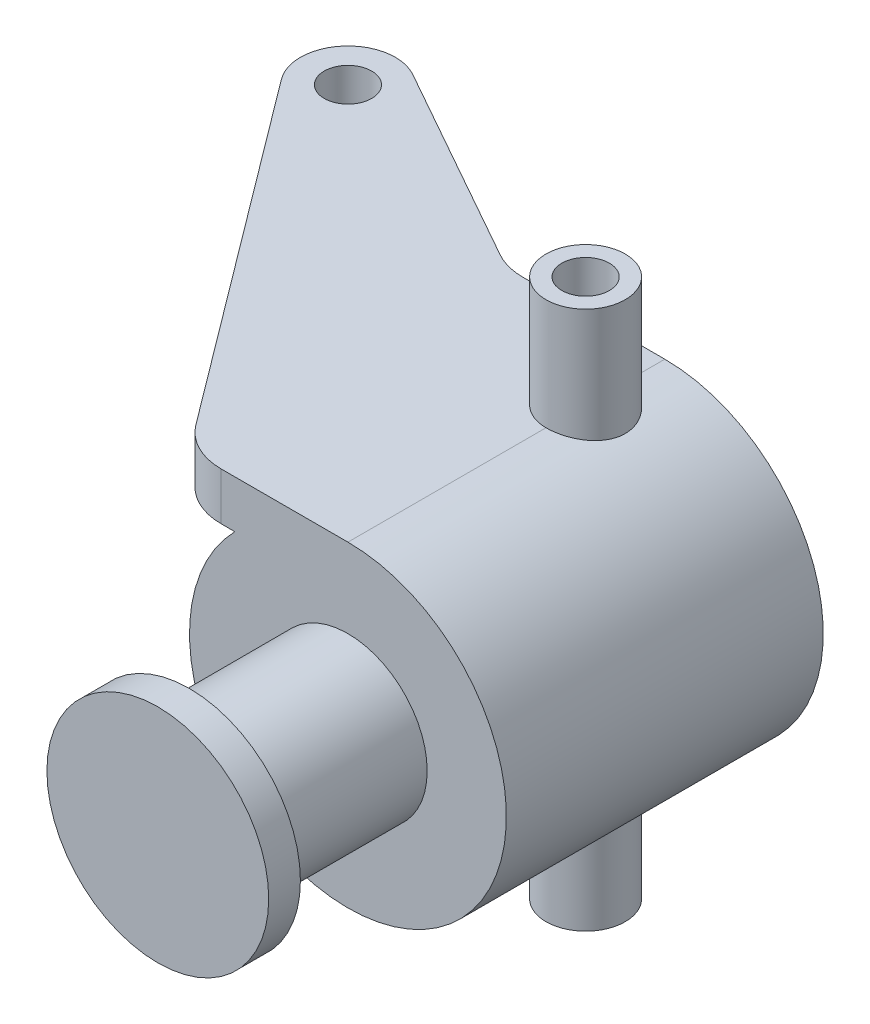
ISO-10303-21;
HEADER;
FILE_DESCRIPTION(('STEP AP214'),'2;1');
FILE_NAME('part.step','',(''),(''),'','','');
FILE_SCHEMA(('AUTOMOTIVE_DESIGN { 1 0 10303 214 1 1 1 1 }'));
ENDSEC;
DATA;
#1=APPLICATION_CONTEXT('core data for automotive mechanical design processes');
#2=APPLICATION_PROTOCOL_DEFINITION('international standard','automotive_design',2000,#1);
#3=PRODUCT_CONTEXT('',#1,'mechanical');
#4=PRODUCT('Part','Part','',(#3));
#5=PRODUCT_RELATED_PRODUCT_CATEGORY('part','',(#4));
#6=PRODUCT_DEFINITION_FORMATION('','',#4);
#7=PRODUCT_DEFINITION_CONTEXT('part definition',#1,'design');
#8=PRODUCT_DEFINITION('design','',#6,#7);
#9=PRODUCT_DEFINITION_SHAPE('','',#8);
#10=(LENGTH_UNIT() NAMED_UNIT(*) SI_UNIT(.MILLI.,.METRE.));
#11=(NAMED_UNIT(*) PLANE_ANGLE_UNIT() SI_UNIT($,.RADIAN.));
#12=(NAMED_UNIT(*) SI_UNIT($,.STERADIAN.) SOLID_ANGLE_UNIT());
#13=UNCERTAINTY_MEASURE_WITH_UNIT(LENGTH_MEASURE(1.E-05),#10,'distance_accuracy_value','');
#14=(GEOMETRIC_REPRESENTATION_CONTEXT(3) GLOBAL_UNCERTAINTY_ASSIGNED_CONTEXT((#13)) GLOBAL_UNIT_ASSIGNED_CONTEXT((#10,
#11,#12)) REPRESENTATION_CONTEXT('',''));
#15=CARTESIAN_POINT('',(0.,0.,0.));
#16=DIRECTION('',(0.,0.,1.));
#17=DIRECTION('',(1.,0.,0.));
#18=AXIS2_PLACEMENT_3D('',#15,#16,#17);
#19=CARTESIAN_POINT('',(0.,0.,-12.7));
#20=DIRECTION('',(0.,0.,1.));
#21=DIRECTION('',(-1.,0.,0.));
#22=AXIS2_PLACEMENT_3D('',#19,#20,#21);
#23=CYLINDRICAL_SURFACE('',#22,12.7);
#24=CARTESIAN_POINT('',(0.,-12.7,-3.175));
#25=CARTESIAN_POINT('',(0.175421054350931,-12.699997033873,-3.17500492281244));
#26=CARTESIAN_POINT('',(0.350897100741782,-12.6963292371237,-3.18958711580452));
#27=CARTESIAN_POINT('',(0.696820051980961,-12.6820530760661,-3.24744323693316));
#28=CARTESIAN_POINT('',(0.867264049209732,-12.6714407780562,-3.29073342685512));
#29=CARTESIAN_POINT('',(1.19807751278645,-12.6444507573614,-3.40452975316141));
#30=CARTESIAN_POINT('',(1.35845880926017,-12.6280799601569,-3.47500320728065));
#31=CARTESIAN_POINT('',(1.6651226791977,-12.591316443928,-3.64105060892825));
#32=CARTESIAN_POINT('',(1.81140477687155,-12.5709235892464,-3.73662540311848));
#33=CARTESIAN_POINT('',(2.08873074612027,-12.5278602543576,-3.95224167143468));
#34=CARTESIAN_POINT('',(2.2194428772959,-12.5051546346354,-4.07270283366335));
#35=CARTESIAN_POINT('',(2.45903522924703,-12.4602582924964,-4.33377383372412));
#36=CARTESIAN_POINT('',(2.56791298487579,-12.4380676284689,-4.47438594357101));
#37=CARTESIAN_POINT('',(2.76230618225783,-12.3963594189446,-4.77434322992663));
#38=CARTESIAN_POINT('',(2.84745052370821,-12.3768864828385,-4.93393567187847));
#39=CARTESIAN_POINT('',(2.98957345643241,-12.3433309736481,-5.26573413801374));
#40=CARTESIAN_POINT('',(3.04655655068163,-12.3292475388652,-5.43793814055276));
#41=CARTESIAN_POINT('',(3.12960773790342,-12.3084267567389,-5.78642373786018));
#42=CARTESIAN_POINT('',(3.15627230130285,-12.3015478927701,-5.96255452994708));
#43=CARTESIAN_POINT('',(3.17978742389056,-12.2954915053947,-6.31691347104861));
#44=CARTESIAN_POINT('',(3.176642833515,-12.2963127290579,-6.49514127413169));
#45=CARTESIAN_POINT('',(3.14110481048738,-12.3054365167727,-6.84406345972766));
#46=CARTESIAN_POINT('',(3.10942215340351,-12.3135572669878,-7.01483573210162));
#47=CARTESIAN_POINT('',(3.01884119561133,-12.3360753547043,-7.34856089109507));
#48=CARTESIAN_POINT('',(2.95994095604688,-12.3504731393489,-7.51151321974455));
#49=CARTESIAN_POINT('',(2.81599106163371,-12.3840899110032,-7.82687880106701));
#50=CARTESIAN_POINT('',(2.73068344564301,-12.4033560981112,-7.97916906362126));
#51=CARTESIAN_POINT('',(2.53652078423164,-12.4445122129069,-8.26752793565194));
#52=CARTESIAN_POINT('',(2.42766161831204,-12.4664025994163,-8.40359370007568));
#53=CARTESIAN_POINT('',(2.18580424890858,-12.5111061380944,-8.65971431988649));
#54=CARTESIAN_POINT('',(2.05220624645107,-12.5339278039511,-8.77920200396319));
#55=CARTESIAN_POINT('',(1.76659522538283,-12.5773596047504,-8.99418496321526));
#56=CARTESIAN_POINT('',(1.61458164448181,-12.5979696721292,-9.08967950552455));
#57=CARTESIAN_POINT('',(1.29564529770894,-12.6347586626604,-9.25417374084162));
#58=CARTESIAN_POINT('',(1.12867311562492,-12.6509221227036,-9.32308130353854));
#59=CARTESIAN_POINT('',(0.785020883902435,-12.676884242985,-9.43169163041859));
#60=CARTESIAN_POINT('',(0.608342698201858,-12.6866841206815,-9.47139998108506));
#61=CARTESIAN_POINT('',(0.255142937325556,-12.6986347345775,-9.51961851376621));
#62=CARTESIAN_POINT('',(0.0787330573083778,-12.7009747992586,-9.52890107185939));
#63=CARTESIAN_POINT('',(-0.273119584996526,-12.6982813685726,-9.51812294564922));
#64=CARTESIAN_POINT('',(-0.448562432914396,-12.6932485369526,-9.49806490274183));
#65=CARTESIAN_POINT('',(-0.790816868910239,-12.6764961338623,-9.42981157723825));
#66=CARTESIAN_POINT('',(-0.957717835150521,-12.6648767569325,-9.38203765897374));
#67=CARTESIAN_POINT('',(-1.28112793569116,-12.6362609570897,-9.26019000547309));
#68=CARTESIAN_POINT('',(-1.43763601861911,-12.6192639911647,-9.18611361420368));
#69=CARTESIAN_POINT('',(-1.73889063454314,-12.5813250177716,-9.0122668605486));
#70=CARTESIAN_POINT('',(-1.88337918521904,-12.5603183592593,-8.91206389542726));
#71=CARTESIAN_POINT('',(-2.15376466554501,-12.5167921111412,-8.68936135971267));
#72=CARTESIAN_POINT('',(-2.27965837982672,-12.4942722608556,-8.56685794114268));
#73=CARTESIAN_POINT('',(-2.51246336908675,-12.4495762556412,-8.29944584954746));
#74=CARTESIAN_POINT('',(-2.6188328531313,-12.4274221051899,-8.15406102865081));
#75=CARTESIAN_POINT('',(-2.80566443991221,-12.3865825924258,-7.84704925704162));
#76=CARTESIAN_POINT('',(-2.88612769264178,-12.3678970761539,-7.68542302771299));
#77=CARTESIAN_POINT('',(-3.0182638402854,-12.3363163381503,-7.35138288757303));
#78=CARTESIAN_POINT('',(-3.07010730622843,-12.3233869021911,-7.17903985340403));
#79=CARTESIAN_POINT('',(-3.14398164687971,-12.3047494152553,-6.82771126654123));
#80=CARTESIAN_POINT('',(-3.16601904149253,-12.2990397850061,-6.64872717534393));
#81=CARTESIAN_POINT('',(-3.17931501621074,-12.2956087422145,-6.2947104994796));
#82=CARTESIAN_POINT('',(-3.17143955029538,-12.2976625750886,-6.11971209561251));
#83=CARTESIAN_POINT('',(-3.1271152390873,-12.3090074061495,-5.77362343562374));
#84=CARTESIAN_POINT('',(-3.09066696801937,-12.3182982588945,-5.6025331010331));
#85=CARTESIAN_POINT('',(-2.9907046261569,-12.3429450180985,-5.27005876165632));
#86=CARTESIAN_POINT('',(-2.92735297324093,-12.3582644892528,-5.10862303724463));
#87=CARTESIAN_POINT('',(-2.7755107337966,-12.3932474960913,-4.79855660658629));
#88=CARTESIAN_POINT('',(-2.68701666057215,-12.4129116342002,-4.64992768008686));
#89=CARTESIAN_POINT('',(-2.48468673461549,-12.4550092586012,-4.36550936861324));
#90=CARTESIAN_POINT('',(-2.37025002816433,-12.4775016056119,-4.23015606125285));
#91=CARTESIAN_POINT('',(-2.12045416901821,-12.5223699100401,-3.98029208851616));
#92=CARTESIAN_POINT('',(-1.98509005500274,-12.5447458385544,-3.86578637959415));
#93=CARTESIAN_POINT('',(-1.6943230585205,-12.5873437112106,-3.65884606353831));
#94=CARTESIAN_POINT('',(-1.53860166056969,-12.6075193062447,-3.56684873439517));
#95=CARTESIAN_POINT('',(-1.21341315929717,-12.6429542453063,-3.41048453677586));
#96=CARTESIAN_POINT('',(-1.04395600927443,-12.658217110062,-3.34609786996059));
#97=CARTESIAN_POINT('',(-0.72900170269868,-12.6798505941374,-3.25633962580224));
#98=CARTESIAN_POINT('',(-0.585004695088743,-12.6873547169487,-3.22590320220357));
#99=CARTESIAN_POINT('',(-0.294017851418465,-12.6974304774096,-3.18523208600022));
#100=CARTESIAN_POINT('',(-0.147028241296871,-12.700002486044,-3.17499587397045));
#101=CARTESIAN_POINT('',(0.,-12.7,-3.175));
#102=B_SPLINE_CURVE_WITH_KNOTS('',3,(#24,#25,#26,#27,#28,#29,#30,#31,#32,#33,#34,#35,#36,#37,
#38,#39,#40,#41,#42,#43,#44,#45,#46,#47,#48,#49,#50,#51,#52,#53,#54,#55,#56,#57,#58,#59,#60,#61,
#62,#63,#64,#65,#66,#67,#68,#69,#70,#71,#72,#73,#74,#75,#76,#77,#78,#79,#80,#81,#82,#83,#84,#85,
#86,#87,#88,#89,#90,#91,#92,#93,#94,#95,#96,#97,#98,#99,#100,#101),.UNSPECIFIED.,.T.,.F.,(4,2,2,
2,2,2,2,2,2,2,2,2,2,2,2,2,2,2,2,2,2,2,2,2,2,2,2,2,2,2,2,2,2,2,2,2,2,2,4),(0.,0.5257243580655,
1.05174676993359,1.57713870983892,2.10254837335841,2.63767221675277,3.17285644277798,
3.71599137305291,4.25903942808496,4.79120824630598,5.3232904734557,5.84247618671884,
6.36169889010143,6.8861628400674,7.41071862276906,7.9502317705812,8.48976139571985,
9.0311441807632,9.57242335981323,10.09985087283,10.6272309069567,11.1467958106174,
11.6664131950588,12.1952509368702,12.7241800170734,13.266092111565,13.8079801469349,
14.34660272276,14.885107458967,15.4081433519175,15.9311687337377,16.4510804786766,
16.9710643590661,17.5046127008447,18.0382877269755,18.5816279265763,19.1245778677202,
19.5652441424438,20.005877269746),.UNSPECIFIED.);
#103=CARTESIAN_POINT('',(0.,-12.7,-3.175));
#104=VERTEX_POINT('',#103);
#105=EDGE_CURVE('E11',#104,#104,#102,.T.);
#106=ORIENTED_EDGE('',*,*,#105,.T.);
#107=EDGE_LOOP('',(#106));
#108=FACE_BOUND('',#107,.T.);
#109=CARTESIAN_POINT('',(0.,12.7,-3.175));
#110=CARTESIAN_POINT('',(-0.175421054350931,12.699997033873,-3.17500492281244));
#111=CARTESIAN_POINT('',(-0.350897100741782,12.6963292371237,-3.18958711580452));
#112=CARTESIAN_POINT('',(-0.696820051980961,12.6820530760661,-3.24744323693316));
#113=CARTESIAN_POINT('',(-0.867264049209732,12.6714407780562,-3.29073342685512));
#114=CARTESIAN_POINT('',(-1.19807751278645,12.6444507573614,-3.40452975316141));
#115=CARTESIAN_POINT('',(-1.35845880926017,12.6280799601569,-3.47500320728065));
#116=CARTESIAN_POINT('',(-1.6651226791977,12.591316443928,-3.64105060892825));
#117=CARTESIAN_POINT('',(-1.81140477687155,12.5709235892464,-3.73662540311848));
#118=CARTESIAN_POINT('',(-2.08873074612027,12.5278602543576,-3.95224167143468));
#119=CARTESIAN_POINT('',(-2.2194428772959,12.5051546346354,-4.07270283366335));
#120=CARTESIAN_POINT('',(-2.45903522924703,12.4602582924964,-4.33377383372412));
#121=CARTESIAN_POINT('',(-2.56791298487579,12.4380676284689,-4.47438594357101));
#122=CARTESIAN_POINT('',(-2.76230618225783,12.3963594189446,-4.77434322992663));
#123=CARTESIAN_POINT('',(-2.84745052370821,12.3768864828385,-4.93393567187847));
#124=CARTESIAN_POINT('',(-2.98957345643241,12.3433309736481,-5.26573413801374));
#125=CARTESIAN_POINT('',(-3.04655655068163,12.3292475388652,-5.43793814055276));
#126=CARTESIAN_POINT('',(-3.12960773790342,12.3084267567389,-5.78642373786018));
#127=CARTESIAN_POINT('',(-3.15627230130285,12.3015478927701,-5.96255452994708));
#128=CARTESIAN_POINT('',(-3.17978742389056,12.2954915053947,-6.31691347104861));
#129=CARTESIAN_POINT('',(-3.176642833515,12.2963127290579,-6.49514127413169));
#130=CARTESIAN_POINT('',(-3.14110481048738,12.3054365167727,-6.84406345972766));
#131=CARTESIAN_POINT('',(-3.10942215340351,12.3135572669878,-7.01483573210162));
#132=CARTESIAN_POINT('',(-3.01884119561133,12.3360753547043,-7.34856089109507));
#133=CARTESIAN_POINT('',(-2.95994095604688,12.3504731393489,-7.51151321974455));
#134=CARTESIAN_POINT('',(-2.81599106163371,12.3840899110032,-7.82687880106701));
#135=CARTESIAN_POINT('',(-2.73068344564301,12.4033560981112,-7.97916906362126));
#136=CARTESIAN_POINT('',(-2.53652078423164,12.4445122129069,-8.26752793565194));
#137=CARTESIAN_POINT('',(-2.42766161831204,12.4664025994163,-8.40359370007568));
#138=CARTESIAN_POINT('',(-2.18580424890858,12.5111061380944,-8.65971431988649));
#139=CARTESIAN_POINT('',(-2.05220624645107,12.5339278039511,-8.77920200396319));
#140=CARTESIAN_POINT('',(-1.76659522538283,12.5773596047504,-8.99418496321526));
#141=CARTESIAN_POINT('',(-1.61458164448181,12.5979696721292,-9.08967950552455));
#142=CARTESIAN_POINT('',(-1.29564529770894,12.6347586626604,-9.25417374084162));
#143=CARTESIAN_POINT('',(-1.12867311562492,12.6509221227036,-9.32308130353854));
#144=CARTESIAN_POINT('',(-0.785020883902435,12.676884242985,-9.43169163041859));
#145=CARTESIAN_POINT('',(-0.608342698201858,12.6866841206815,-9.47139998108506));
#146=CARTESIAN_POINT('',(-0.255142937325556,12.6986347345775,-9.51961851376621));
#147=CARTESIAN_POINT('',(-0.0787330573083778,12.7009747992586,-9.52890107185939));
#148=CARTESIAN_POINT('',(0.273119584996526,12.6982813685726,-9.51812294564922));
#149=CARTESIAN_POINT('',(0.448562432914396,12.6932485369526,-9.49806490274183));
#150=CARTESIAN_POINT('',(0.790816868910239,12.6764961338623,-9.42981157723825));
#151=CARTESIAN_POINT('',(0.957717835150521,12.6648767569325,-9.38203765897374));
#152=CARTESIAN_POINT('',(1.28112793569116,12.6362609570897,-9.26019000547309));
#153=CARTESIAN_POINT('',(1.43763601861911,12.6192639911647,-9.18611361420368));
#154=CARTESIAN_POINT('',(1.73889063454314,12.5813250177716,-9.0122668605486));
#155=CARTESIAN_POINT('',(1.88337918521904,12.5603183592593,-8.91206389542726));
#156=CARTESIAN_POINT('',(2.15376466554501,12.5167921111412,-8.68936135971267));
#157=CARTESIAN_POINT('',(2.27965837982672,12.4942722608556,-8.56685794114268));
#158=CARTESIAN_POINT('',(2.51246336908675,12.4495762556412,-8.29944584954746));
#159=CARTESIAN_POINT('',(2.6188328531313,12.4274221051899,-8.15406102865081));
#160=CARTESIAN_POINT('',(2.80566443991221,12.3865825924258,-7.84704925704162));
#161=CARTESIAN_POINT('',(2.88612769264178,12.3678970761539,-7.68542302771299));
#162=CARTESIAN_POINT('',(3.0182638402854,12.3363163381503,-7.35138288757303));
#163=CARTESIAN_POINT('',(3.07010730622843,12.3233869021911,-7.17903985340403));
#164=CARTESIAN_POINT('',(3.14398164687971,12.3047494152553,-6.82771126654123));
#165=CARTESIAN_POINT('',(3.16601904149253,12.2990397850061,-6.64872717534393));
#166=CARTESIAN_POINT('',(3.17931501621074,12.2956087422145,-6.2947104994796));
#167=CARTESIAN_POINT('',(3.17143955029538,12.2976625750886,-6.11971209561251));
#168=CARTESIAN_POINT('',(3.1271152390873,12.3090074061495,-5.77362343562374));
#169=CARTESIAN_POINT('',(3.09066696801937,12.3182982588945,-5.6025331010331));
#170=CARTESIAN_POINT('',(2.9907046261569,12.3429450180985,-5.27005876165632));
#171=CARTESIAN_POINT('',(2.92735297324093,12.3582644892528,-5.10862303724463));
#172=CARTESIAN_POINT('',(2.7755107337966,12.3932474960913,-4.79855660658629));
#173=CARTESIAN_POINT('',(2.68701666057215,12.4129116342002,-4.64992768008686));
#174=CARTESIAN_POINT('',(2.48468673461549,12.4550092586012,-4.36550936861324));
#175=CARTESIAN_POINT('',(2.37025002816433,12.4775016056119,-4.23015606125285));
#176=CARTESIAN_POINT('',(2.12045416901821,12.5223699100401,-3.98029208851616));
#177=CARTESIAN_POINT('',(1.98509005500274,12.5447458385544,-3.86578637959415));
#178=CARTESIAN_POINT('',(1.6943230585205,12.5873437112106,-3.65884606353831));
#179=CARTESIAN_POINT('',(1.53860166056969,12.6075193062447,-3.56684873439517));
#180=CARTESIAN_POINT('',(1.21341315929717,12.6429542453063,-3.41048453677586));
#181=CARTESIAN_POINT('',(1.04395600927443,12.658217110062,-3.34609786996059));
#182=CARTESIAN_POINT('',(0.72900170269868,12.6798505941374,-3.25633962580224));
#183=CARTESIAN_POINT('',(0.585004695088743,12.6873547169487,-3.22590320220357));
#184=CARTESIAN_POINT('',(0.294017851418465,12.6974304774096,-3.18523208600022));
#185=CARTESIAN_POINT('',(0.147028241296871,12.700002486044,-3.17499587397045));
#186=CARTESIAN_POINT('',(0.,12.7,-3.175));
#187=B_SPLINE_CURVE_WITH_KNOTS('',3,(#109,#110,#111,#112,#113,#114,#115,#116,#117,#118,#119,
#120,#121,#122,#123,#124,#125,#126,#127,#128,#129,#130,#131,#132,#133,#134,#135,#136,#137,#138,
#139,#140,#141,#142,#143,#144,#145,#146,#147,#148,#149,#150,#151,#152,#153,#154,#155,#156,#157,
#158,#159,#160,#161,#162,#163,#164,#165,#166,#167,#168,#169,#170,#171,#172,#173,#174,#175,#176,
#177,#178,#179,#180,#181,#182,#183,#184,#185,#186),.UNSPECIFIED.,.T.,.F.,(4,2,2,2,2,2,2,2,2,2,2,
2,2,2,2,2,2,2,2,2,2,2,2,2,2,2,2,2,2,2,2,2,2,2,2,2,2,2,4),(0.,0.5257243580655,1.05174676993359,
1.57713870983892,2.10254837335841,2.63767221675277,3.17285644277798,3.71599137305291,
4.25903942808496,4.79120824630598,5.3232904734557,5.84247618671884,6.36169889010143,
6.8861628400674,7.41071862276906,7.9502317705812,8.48976139571985,9.0311441807632,
9.57242335981323,10.09985087283,10.6272309069567,11.1467958106174,11.6664131950588,
12.1952509368702,12.7241800170734,13.266092111565,13.8079801469349,14.34660272276,
14.885107458967,15.4081433519175,15.9311687337377,16.4510804786766,16.9710643590661,
17.5046127008447,18.0382877269755,18.5816279265763,19.1245778677202,19.5652441424438,
20.005877269746),.UNSPECIFIED.);
#188=CARTESIAN_POINT('',(0.,12.7,-9.525));
#189=VERTEX_POINT('',#188);
#190=CARTESIAN_POINT('',(0.,12.7,-3.175));
#191=VERTEX_POINT('',#190);
#192=EDGE_CURVE('E121',#189,#191,#187,.T.);
#193=ORIENTED_EDGE('',*,*,#192,.T.);
#194=DIRECTION('',(0.,0.,1.));
#195=VECTOR('',#194,1.);
#196=CARTESIAN_POINT('',(0.,12.7,12.7));
#197=LINE('',#196,#195);
#198=CARTESIAN_POINT('',(0.,12.7,12.7));
#199=VERTEX_POINT('',#198);
#200=EDGE_CURVE('E117',#191,#199,#197,.T.);
#201=ORIENTED_EDGE('',*,*,#200,.T.);
#202=CARTESIAN_POINT('',(0.,0.,12.7));
#203=DIRECTION('',(0.,0.,1.));
#204=DIRECTION('',(1.,0.,0.));
#205=AXIS2_PLACEMENT_3D('',#202,#203,#204);
#206=CIRCLE('',#205,12.7);
#207=CARTESIAN_POINT('',(-9.06961410424948,8.89,12.7));
#208=VERTEX_POINT('',#207);
#209=EDGE_CURVE('E367',#208,#199,#206,.T.);
#210=ORIENTED_EDGE('',*,*,#209,.F.);
#211=DIRECTION('',(0.,0.,1.));
#212=VECTOR('',#211,1.);
#213=CARTESIAN_POINT('',(-9.06961410424948,8.89,-12.7));
#214=LINE('',#213,#212);
#215=CARTESIAN_POINT('',(-9.06961410424948,8.89,-12.7));
#216=VERTEX_POINT('',#215);
#217=EDGE_CURVE('E371',#216,#208,#214,.T.);
#218=ORIENTED_EDGE('',*,*,#217,.F.);
#219=CARTESIAN_POINT('',(0.,0.,-12.7));
#220=DIRECTION('',(0.,0.,1.));
#221=DIRECTION('',(1.,0.,0.));
#222=AXIS2_PLACEMENT_3D('',#219,#220,#221);
#223=CIRCLE('',#222,12.7);
#224=CARTESIAN_POINT('',(0.,12.7,-12.7));
#225=VERTEX_POINT('',#224);
#226=EDGE_CURVE('E123',#216,#225,#223,.T.);
#227=ORIENTED_EDGE('',*,*,#226,.T.);
#228=EDGE_CURVE('E114',#225,#189,#197,.T.);
#229=ORIENTED_EDGE('',*,*,#228,.T.);
#230=EDGE_LOOP('',(#193,#201,#210,#218,#227,#229));
#231=FACE_BOUND('',#230,.T.);
#232=ADVANCED_FACE('F39',(#108,#231),#23,.T.);
#233=CARTESIAN_POINT('',(0.,0.,-12.7));
#234=DIRECTION('',(0.,0.,-1.));
#235=DIRECTION('',(1.,0.,0.));
#236=AXIS2_PLACEMENT_3D('',#233,#234,#235);
#237=PLANE('',#236);
#238=ORIENTED_EDGE('',*,*,#226,.F.);
#239=DIRECTION('',(1.,0.,0.));
#240=VECTOR('',#239,1.);
#241=CARTESIAN_POINT('',(0.,8.89,-12.7));
#242=LINE('',#241,#240);
#243=CARTESIAN_POINT('',(-11.3685962714996,8.89,-12.7));
#244=VERTEX_POINT('',#243);
#245=EDGE_CURVE('E61',#244,#216,#242,.T.);
#246=ORIENTED_EDGE('',*,*,#245,.F.);
#247=DIRECTION('',(0.,1.,0.));
#248=VECTOR('',#247,1.);
#249=CARTESIAN_POINT('',(-11.3685962714996,8.89,-12.7));
#250=LINE('',#249,#248);
#251=CARTESIAN_POINT('',(-11.3685962714996,12.7,-12.7));
#252=VERTEX_POINT('',#251);
#253=EDGE_CURVE('E378',#244,#252,#250,.T.);
#254=ORIENTED_EDGE('',*,*,#253,.T.);
#255=DIRECTION('',(1.,0.,0.));
#256=VECTOR('',#255,1.);
#257=CARTESIAN_POINT('',(0.,12.7,-12.7));
#258=LINE('',#257,#256);
#259=EDGE_CURVE('E373',#252,#225,#258,.T.);
#260=ORIENTED_EDGE('',*,*,#259,.T.);
#261=EDGE_LOOP('',(#238,#246,#254,#260));
#262=FACE_BOUND('',#261,.T.);
#263=ADVANCED_FACE('F202',(#262),#237,.T.);
#264=CARTESIAN_POINT('',(0.,0.,12.7));
#265=DIRECTION('',(0.,0.,-1.));
#266=DIRECTION('',(1.,0.,0.));
#267=AXIS2_PLACEMENT_3D('',#264,#265,#266);
#268=PLANE('',#267);
#269=CARTESIAN_POINT('',(0.,0.,12.7));
#270=DIRECTION('',(0.,0.,1.));
#271=DIRECTION('',(1.,0.,0.));
#272=AXIS2_PLACEMENT_3D('',#269,#270,#271);
#273=CIRCLE('',#272,6.35);
#274=CARTESIAN_POINT('',(6.35,0.,12.7));
#275=VERTEX_POINT('',#274);
#276=EDGE_CURVE('E119',#275,#275,#273,.F.);
#277=ORIENTED_EDGE('',*,*,#276,.T.);
#278=EDGE_LOOP('',(#277));
#279=FACE_BOUND('',#278,.T.);
#280=ORIENTED_EDGE('',*,*,#209,.T.);
#281=DIRECTION('',(-1.,0.,0.));
#282=VECTOR('',#281,1.);
#283=CARTESIAN_POINT('',(-10.16,12.7,12.7));
#284=LINE('',#283,#282);
#285=CARTESIAN_POINT('',(-10.16,12.7,12.7));
#286=VERTEX_POINT('',#285);
#287=EDGE_CURVE('E369',#199,#286,#284,.T.);
#288=ORIENTED_EDGE('',*,*,#287,.T.);
#289=DIRECTION('',(0.,1.,0.));
#290=VECTOR('',#289,1.);
#291=CARTESIAN_POINT('',(-10.16,8.89,12.7));
#292=LINE('',#291,#290);
#293=CARTESIAN_POINT('',(-10.16,8.89,12.7));
#294=VERTEX_POINT('',#293);
#295=EDGE_CURVE('E393',#294,#286,#292,.T.);
#296=ORIENTED_EDGE('',*,*,#295,.F.);
#297=DIRECTION('',(-1.,0.,0.));
#298=VECTOR('',#297,1.);
#299=CARTESIAN_POINT('',(-10.16,8.89,12.7));
#300=LINE('',#299,#298);
#301=EDGE_CURVE('E124',#208,#294,#300,.T.);
#302=ORIENTED_EDGE('',*,*,#301,.F.);
#303=EDGE_LOOP('',(#280,#288,#296,#302));
#304=FACE_BOUND('',#303,.T.);
#305=ADVANCED_FACE('F179',(#279,#304),#268,.F.);
#306=CARTESIAN_POINT('',(-11.3685962714996,8.89,-17.78));
#307=DIRECTION('',(0.,-1.,0.));
#308=DIRECTION('',(0.,0.,1.));
#309=AXIS2_PLACEMENT_3D('',#306,#307,#308);
#310=PLANE('',#309);
#311=CARTESIAN_POINT('',(-31.75,8.89,-19.05));
#312=DIRECTION('',(0.,-1.,0.));
#313=DIRECTION('',(0.,0.,-1.));
#314=AXIS2_PLACEMENT_3D('',#311,#312,#313);
#315=CIRCLE('',#314,1.905);
#316=CARTESIAN_POINT('',(-31.75,8.89,-20.955));
#317=VERTEX_POINT('',#316);
#318=EDGE_CURVE('E418',#317,#317,#315,.T.);
#319=ORIENTED_EDGE('',*,*,#318,.F.);
#320=EDGE_LOOP('',(#319));
#321=FACE_BOUND('',#320,.T.);
#322=ORIENTED_EDGE('',*,*,#217,.T.);
#323=ORIENTED_EDGE('',*,*,#301,.T.);
#324=CARTESIAN_POINT('',(-10.16,8.89,7.62));
#325=DIRECTION('',(0.,-1.,0.));
#326=DIRECTION('',(0.,0.,-1.));
#327=AXIS2_PLACEMENT_3D('',#324,#325,#326);
#328=CIRCLE('',#327,5.08);
#329=CARTESIAN_POINT('',(-14.2240000000001,8.89,10.668));
#330=VERTEX_POINT('',#329);
#331=EDGE_CURVE('E399',#294,#330,#328,.T.);
#332=ORIENTED_EDGE('',*,*,#331,.T.);
#333=DIRECTION('',(-0.599999999999999,0.,-0.800000000000001));
#334=VECTOR('',#333,1.);
#335=CARTESIAN_POINT('',(-34.798,8.89,-16.764));
#336=LINE('',#335,#334);
#337=CARTESIAN_POINT('',(-34.798,8.89,-16.764));
#338=VERTEX_POINT('',#337);
#339=EDGE_CURVE('E403',#330,#338,#336,.T.);
#340=ORIENTED_EDGE('',*,*,#339,.T.);
#341=CARTESIAN_POINT('',(-31.75,8.89,-19.05));
#342=DIRECTION('',(0.,-1.,0.));
#343=DIRECTION('',(0.,0.,1.));
#344=AXIS2_PLACEMENT_3D('',#341,#342,#343);
#345=CIRCLE('',#344,3.81);
#346=CARTESIAN_POINT('',(-29.881257888145,8.89,-22.370226335565));
#347=VERTEX_POINT('',#346);
#348=EDGE_CURVE('E405',#338,#347,#345,.T.);
#349=ORIENTED_EDGE('',*,*,#348,.T.);
#350=DIRECTION('',(0.871450481775601,0.,0.490483493925202));
#351=VECTOR('',#350,1.);
#352=CARTESIAN_POINT('',(-13.8602524206396,8.89,-13.35303155258));
#353=LINE('',#352,#351);
#354=CARTESIAN_POINT('',(-13.8602524206396,8.89,-13.35303155258));
#355=VERTEX_POINT('',#354);
#356=EDGE_CURVE('E411',#347,#355,#353,.T.);
#357=ORIENTED_EDGE('',*,*,#356,.T.);
#358=CARTESIAN_POINT('',(-11.3685962714996,8.89,-17.78));
#359=DIRECTION('',(0.,1.,0.));
#360=DIRECTION('',(0.,0.,1.));
#361=AXIS2_PLACEMENT_3D('',#358,#359,#360);
#362=CIRCLE('',#361,5.08);
#363=EDGE_CURVE('E414',#355,#244,#362,.T.);
#364=ORIENTED_EDGE('',*,*,#363,.T.);
#365=ORIENTED_EDGE('',*,*,#245,.T.);
#366=EDGE_LOOP('',(#322,#323,#332,#340,#349,#357,#364,#365));
#367=FACE_BOUND('',#366,.T.);
#368=ADVANCED_FACE('F175',(#321,#367),#310,.T.);
#369=CARTESIAN_POINT('',(-11.3685962714996,8.89,-17.78));
#370=DIRECTION('',(0.,1.,0.));
#371=DIRECTION('',(0.,0.,-1.));
#372=AXIS2_PLACEMENT_3D('',#369,#370,#371);
#373=CYLINDRICAL_SURFACE('',#372,5.08);
#374=CARTESIAN_POINT('',(-11.3685962714996,12.7,-17.78));
#375=DIRECTION('',(0.,1.,0.));
#376=DIRECTION('',(0.,0.,1.));
#377=AXIS2_PLACEMENT_3D('',#374,#375,#376);
#378=CIRCLE('',#377,5.08);
#379=CARTESIAN_POINT('',(-13.8602524206396,12.7,-13.35303155258));
#380=VERTEX_POINT('',#379);
#381=EDGE_CURVE('E374',#380,#252,#378,.T.);
#382=ORIENTED_EDGE('',*,*,#381,.T.);
#383=ORIENTED_EDGE('',*,*,#253,.F.);
#384=ORIENTED_EDGE('',*,*,#363,.F.);
#385=DIRECTION('',(0.,1.,0.));
#386=VECTOR('',#385,1.);
#387=CARTESIAN_POINT('',(-13.8602524206396,8.89,-13.35303155258));
#388=LINE('',#387,#386);
#389=EDGE_CURVE('E381',#355,#380,#388,.T.);
#390=ORIENTED_EDGE('',*,*,#389,.T.);
#391=EDGE_LOOP('',(#382,#383,#384,#390));
#392=FACE_BOUND('',#391,.T.);
#393=ADVANCED_FACE('F178',(#392),#373,.F.);
#394=CARTESIAN_POINT('',(-13.8602524206396,8.89,-13.35303155258));
#395=DIRECTION('',(0.490483493925202,0.,-0.871450481775601));
#396=DIRECTION('',(0.871450481775601,0.,0.490483493925202));
#397=AXIS2_PLACEMENT_3D('',#394,#395,#396);
#398=PLANE('',#397);
#399=DIRECTION('',(0.871450481775601,0.,0.490483493925202));
#400=VECTOR('',#399,1.);
#401=CARTESIAN_POINT('',(-13.8602524206396,12.7,-13.35303155258));
#402=LINE('',#401,#400);
#403=CARTESIAN_POINT('',(-29.881257888145,12.7,-22.370226335565));
#404=VERTEX_POINT('',#403);
#405=EDGE_CURVE('E424',#404,#380,#402,.T.);
#406=ORIENTED_EDGE('',*,*,#405,.T.);
#407=ORIENTED_EDGE('',*,*,#389,.F.);
#408=ORIENTED_EDGE('',*,*,#356,.F.);
#409=DIRECTION('',(0.,1.,0.));
#410=VECTOR('',#409,1.);
#411=CARTESIAN_POINT('',(-29.881257888145,8.89,-22.370226335565));
#412=LINE('',#411,#410);
#413=EDGE_CURVE('E384',#347,#404,#412,.T.);
#414=ORIENTED_EDGE('',*,*,#413,.T.);
#415=EDGE_LOOP('',(#406,#407,#408,#414));
#416=FACE_BOUND('',#415,.T.);
#417=ADVANCED_FACE('F186',(#416),#398,.T.);
#418=CARTESIAN_POINT('',(-31.75,8.89,-19.05));
#419=DIRECTION('',(0.,1.,0.));
#420=DIRECTION('',(0.,0.,-1.));
#421=AXIS2_PLACEMENT_3D('',#418,#419,#420);
#422=CYLINDRICAL_SURFACE('',#421,3.81);
#423=CARTESIAN_POINT('',(-31.75,12.7,-19.05));
#424=DIRECTION('',(0.,-1.,0.));
#425=DIRECTION('',(0.,0.,1.));
#426=AXIS2_PLACEMENT_3D('',#423,#424,#425);
#427=CIRCLE('',#426,3.81);
#428=CARTESIAN_POINT('',(-34.798,12.7,-16.764));
#429=VERTEX_POINT('',#428);
#430=EDGE_CURVE('E422',#429,#404,#427,.T.);
#431=ORIENTED_EDGE('',*,*,#430,.T.);
#432=ORIENTED_EDGE('',*,*,#413,.F.);
#433=ORIENTED_EDGE('',*,*,#348,.F.);
#434=DIRECTION('',(0.,1.,0.));
#435=VECTOR('',#434,1.);
#436=CARTESIAN_POINT('',(-34.798,8.89,-16.764));
#437=LINE('',#436,#435);
#438=EDGE_CURVE('E387',#338,#429,#437,.T.);
#439=ORIENTED_EDGE('',*,*,#438,.T.);
#440=EDGE_LOOP('',(#431,#432,#433,#439));
#441=FACE_BOUND('',#440,.T.);
#442=ADVANCED_FACE('F190',(#441),#422,.T.);
#443=CARTESIAN_POINT('',(-34.798,8.89,-16.764));
#444=DIRECTION('',(-0.800000000000001,0.,0.599999999999999));
#445=DIRECTION('',(-0.599999999999999,0.,-0.800000000000001));
#446=AXIS2_PLACEMENT_3D('',#443,#444,#445);
#447=PLANE('',#446);
#448=DIRECTION('',(-0.599999999999999,0.,-0.800000000000001));
#449=VECTOR('',#448,1.);
#450=CARTESIAN_POINT('',(-34.798,12.7,-16.764));
#451=LINE('',#450,#449);
#452=CARTESIAN_POINT('',(-14.2240000000001,12.7,10.668));
#453=VERTEX_POINT('',#452);
#454=EDGE_CURVE('E420',#453,#429,#451,.T.);
#455=ORIENTED_EDGE('',*,*,#454,.T.);
#456=ORIENTED_EDGE('',*,*,#438,.F.);
#457=ORIENTED_EDGE('',*,*,#339,.F.);
#458=DIRECTION('',(0.,1.,0.));
#459=VECTOR('',#458,1.);
#460=CARTESIAN_POINT('',(-14.2240000000001,8.89,10.668));
#461=LINE('',#460,#459);
#462=EDGE_CURVE('E390',#330,#453,#461,.T.);
#463=ORIENTED_EDGE('',*,*,#462,.T.);
#464=EDGE_LOOP('',(#455,#456,#457,#463));
#465=FACE_BOUND('',#464,.T.);
#466=ADVANCED_FACE('F194',(#465),#447,.T.);
#467=CARTESIAN_POINT('',(-10.16,8.89,7.62));
#468=DIRECTION('',(0.,1.,0.));
#469=DIRECTION('',(0.,0.,-1.));
#470=AXIS2_PLACEMENT_3D('',#467,#468,#469);
#471=CYLINDRICAL_SURFACE('',#470,5.08);
#472=CARTESIAN_POINT('',(-10.16,12.7,7.62));
#473=DIRECTION('',(0.,-1.,0.));
#474=DIRECTION('',(0.,0.,-1.));
#475=AXIS2_PLACEMENT_3D('',#472,#473,#474);
#476=CIRCLE('',#475,5.08);
#477=EDGE_CURVE('E401',#286,#453,#476,.T.);
#478=ORIENTED_EDGE('',*,*,#477,.T.);
#479=ORIENTED_EDGE('',*,*,#462,.F.);
#480=ORIENTED_EDGE('',*,*,#331,.F.);
#481=ORIENTED_EDGE('',*,*,#295,.T.);
#482=EDGE_LOOP('',(#478,#479,#480,#481));
#483=FACE_BOUND('',#482,.T.);
#484=ADVANCED_FACE('F183',(#483),#471,.T.);
#485=CARTESIAN_POINT('',(-11.3685962714996,12.7,-17.78));
#486=DIRECTION('',(0.,-1.,0.));
#487=DIRECTION('',(0.,0.,1.));
#488=AXIS2_PLACEMENT_3D('',#485,#486,#487);
#489=PLANE('',#488);
#490=CARTESIAN_POINT('',(0.,12.7,-6.35));
#491=DIRECTION('',(0.,1.,0.));
#492=DIRECTION('',(0.,0.,1.));
#493=AXIS2_PLACEMENT_3D('',#490,#491,#492);
#494=CIRCLE('',#493,3.175);
#495=EDGE_CURVE('E43',#191,#189,#494,.F.);
#496=ORIENTED_EDGE('',*,*,#495,.T.);
#497=ORIENTED_EDGE('',*,*,#228,.F.);
#498=ORIENTED_EDGE('',*,*,#259,.F.);
#499=ORIENTED_EDGE('',*,*,#381,.F.);
#500=ORIENTED_EDGE('',*,*,#405,.F.);
#501=ORIENTED_EDGE('',*,*,#430,.F.);
#502=ORIENTED_EDGE('',*,*,#454,.F.);
#503=ORIENTED_EDGE('',*,*,#477,.F.);
#504=ORIENTED_EDGE('',*,*,#287,.F.);
#505=ORIENTED_EDGE('',*,*,#200,.F.);
#506=EDGE_LOOP('',(#496,#497,#498,#499,#500,#501,#502,#503,#504,#505));
#507=FACE_BOUND('',#506,.T.);
#508=CARTESIAN_POINT('',(-31.75,12.7,-19.05));
#509=DIRECTION('',(0.,-1.,0.));
#510=DIRECTION('',(0.,0.,-1.));
#511=AXIS2_PLACEMENT_3D('',#508,#509,#510);
#512=CIRCLE('',#511,1.905);
#513=CARTESIAN_POINT('',(-31.75,12.7,-20.955));
#514=VERTEX_POINT('',#513);
#515=EDGE_CURVE('E434',#514,#514,#512,.T.);
#516=ORIENTED_EDGE('',*,*,#515,.T.);
#517=EDGE_LOOP('',(#516));
#518=FACE_BOUND('',#517,.T.);
#519=ADVANCED_FACE('F111',(#507,#518),#489,.F.);
#520=CARTESIAN_POINT('',(-31.75,8.89,-19.05));
#521=DIRECTION('',(0.,1.,0.));
#522=DIRECTION('',(0.,0.,-1.));
#523=AXIS2_PLACEMENT_3D('',#520,#521,#522);
#524=CYLINDRICAL_SURFACE('',#523,1.905);
#525=CARTESIAN_POINT('',(-31.75,8.89,-20.955));
#526=CARTESIAN_POINT('',(-31.75,8.9296875,-20.955));
#527=CARTESIAN_POINT('',(-31.75,8.969375,-20.955));
#528=CARTESIAN_POINT('',(-31.75,9.04875,-20.955));
#529=CARTESIAN_POINT('',(-31.75,9.0884375,-20.955));
#530=CARTESIAN_POINT('',(-31.75,9.1678125,-20.955));
#531=CARTESIAN_POINT('',(-31.75,9.2075,-20.955));
#532=CARTESIAN_POINT('',(-31.75,9.286875,-20.955));
#533=CARTESIAN_POINT('',(-31.75,9.3265625,-20.955));
#534=CARTESIAN_POINT('',(-31.75,9.4059375,-20.955));
#535=CARTESIAN_POINT('',(-31.75,9.445625,-20.955));
#536=CARTESIAN_POINT('',(-31.75,9.525,-20.955));
#537=CARTESIAN_POINT('',(-31.75,9.5646875,-20.955));
#538=CARTESIAN_POINT('',(-31.75,9.6440625,-20.955));
#539=CARTESIAN_POINT('',(-31.75,9.68375,-20.955));
#540=CARTESIAN_POINT('',(-31.75,9.763125,-20.955));
#541=CARTESIAN_POINT('',(-31.75,9.8028125,-20.955));
#542=CARTESIAN_POINT('',(-31.75,9.8821875,-20.955));
#543=CARTESIAN_POINT('',(-31.75,9.921875,-20.955));
#544=CARTESIAN_POINT('',(-31.75,10.00125,-20.955));
#545=CARTESIAN_POINT('',(-31.75,10.0409375,-20.955));
#546=CARTESIAN_POINT('',(-31.75,10.1203125,-20.955));
#547=CARTESIAN_POINT('',(-31.75,10.16,-20.955));
#548=CARTESIAN_POINT('',(-31.75,10.239375,-20.955));
#549=CARTESIAN_POINT('',(-31.75,10.2790625,-20.955));
#550=CARTESIAN_POINT('',(-31.75,10.3584375,-20.955));
#551=CARTESIAN_POINT('',(-31.75,10.398125,-20.955));
#552=CARTESIAN_POINT('',(-31.75,10.4775,-20.955));
#553=CARTESIAN_POINT('',(-31.75,10.5171875,-20.955));
#554=CARTESIAN_POINT('',(-31.75,10.5965625,-20.955));
#555=CARTESIAN_POINT('',(-31.75,10.63625,-20.955));
#556=CARTESIAN_POINT('',(-31.75,10.715625,-20.955));
#557=CARTESIAN_POINT('',(-31.75,10.7553125,-20.955));
#558=CARTESIAN_POINT('',(-31.75,10.8346875,-20.955));
#559=CARTESIAN_POINT('',(-31.75,10.874375,-20.955));
#560=CARTESIAN_POINT('',(-31.75,10.95375,-20.955));
#561=CARTESIAN_POINT('',(-31.75,10.9934375,-20.955));
#562=CARTESIAN_POINT('',(-31.75,11.0728125,-20.955));
#563=CARTESIAN_POINT('',(-31.75,11.1125,-20.955));
#564=CARTESIAN_POINT('',(-31.75,11.191875,-20.955));
#565=CARTESIAN_POINT('',(-31.75,11.2315625,-20.955));
#566=CARTESIAN_POINT('',(-31.75,11.3109375,-20.955));
#567=CARTESIAN_POINT('',(-31.75,11.350625,-20.955));
#568=CARTESIAN_POINT('',(-31.75,11.43,-20.955));
#569=CARTESIAN_POINT('',(-31.75,11.4696875,-20.955));
#570=CARTESIAN_POINT('',(-31.75,11.5490625,-20.955));
#571=CARTESIAN_POINT('',(-31.75,11.58875,-20.955));
#572=CARTESIAN_POINT('',(-31.75,11.668125,-20.955));
#573=CARTESIAN_POINT('',(-31.75,11.7078125,-20.955));
#574=CARTESIAN_POINT('',(-31.75,11.7871875,-20.955));
#575=CARTESIAN_POINT('',(-31.75,11.826875,-20.955));
#576=CARTESIAN_POINT('',(-31.75,11.90625,-20.955));
#577=CARTESIAN_POINT('',(-31.75,11.9459375,-20.955));
#578=CARTESIAN_POINT('',(-31.75,12.0253125,-20.955));
#579=CARTESIAN_POINT('',(-31.75,12.065,-20.955));
#580=CARTESIAN_POINT('',(-31.75,12.144375,-20.955));
#581=CARTESIAN_POINT('',(-31.75,12.1840625,-20.955));
#582=CARTESIAN_POINT('',(-31.75,12.2634375,-20.955));
#583=CARTESIAN_POINT('',(-31.75,12.303125,-20.955));
#584=CARTESIAN_POINT('',(-31.75,12.3825,-20.955));
#585=CARTESIAN_POINT('',(-31.75,12.4221875,-20.955));
#586=CARTESIAN_POINT('',(-31.75,12.5015625,-20.955));
#587=CARTESIAN_POINT('',(-31.75,12.54125,-20.955));
#588=CARTESIAN_POINT('',(-31.75,12.620625,-20.955));
#589=CARTESIAN_POINT('',(-31.75,12.6603125,-20.955));
#590=CARTESIAN_POINT('',(-31.75,12.7,-20.955));
#591=B_SPLINE_CURVE_WITH_KNOTS('',3,(#525,#526,#527,#528,#529,#530,#531,#532,#533,#534,#535,
#536,#537,#538,#539,#540,#541,#542,#543,#544,#545,#546,#547,#548,#549,#550,#551,#552,#553,#554,
#555,#556,#557,#558,#559,#560,#561,#562,#563,#564,#565,#566,#567,#568,#569,#570,#571,#572,#573,
#574,#575,#576,#577,#578,#579,#580,#581,#582,#583,#584,#585,#586,#587,#588,#589,#590),
.UNSPECIFIED.,.F.,.F.,(4,2,2,2,2,2,2,2,2,2,2,2,2,2,2,2,2,2,2,2,2,2,2,2,2,2,2,2,2,2,2,2,4),(0.,
0.119062500000001,0.238125,0.357187500000002,0.476250000000001,0.5953125,0.714375000000001,
0.833437500000001,0.9525,1.0715625,1.190625,1.3096875,1.42875,1.5478125,1.666875,1.7859375,
1.905,2.0240625,2.143125,2.2621875,2.38125,2.5003125,2.619375,2.7384375,2.8575,2.9765625,
3.095625,3.2146875,3.33375,3.4528125,3.571875,3.6909375,3.81),.UNSPECIFIED.);
#592=EDGE_CURVE('BSEAM170',#317,#514,#591,.T.);
#593=ORIENTED_EDGE('',*,*,#318,.T.);
#594=ORIENTED_EDGE('',*,*,#515,.F.);
#595=ORIENTED_EDGE('',*,*,#592,.T.);
#596=ORIENTED_EDGE('',*,*,#592,.F.);
#597=EDGE_LOOP('',(#593,#595,#594,#596));
#598=FACE_BOUND('',#597,.T.);
#599=ADVANCED_FACE('F170',(#598),#524,.F.);
#600=CARTESIAN_POINT('',(0.,0.,25.4));
#601=DIRECTION('',(0.,0.,-1.));
#602=DIRECTION('',(1.,0.,0.));
#603=AXIS2_PLACEMENT_3D('',#600,#601,#602);
#604=CYLINDRICAL_SURFACE('',#603,6.35);
#605=CARTESIAN_POINT('',(0.,0.,25.4));
#606=DIRECTION('',(0.,0.,-1.));
#607=DIRECTION('',(-1.,0.,0.));
#608=AXIS2_PLACEMENT_3D('',#605,#606,#607);
#609=CIRCLE('',#608,6.35);
#610=CARTESIAN_POINT('',(-6.35,0.,25.4));
#611=VERTEX_POINT('',#610);
#612=EDGE_CURVE('E438',#611,#611,#609,.T.);
#613=ORIENTED_EDGE('',*,*,#612,.T.);
#614=EDGE_LOOP('',(#613));
#615=FACE_BOUND('',#614,.T.);
#616=ORIENTED_EDGE('',*,*,#276,.F.);
#617=EDGE_LOOP('',(#616));
#618=FACE_BOUND('',#617,.T.);
#619=ADVANCED_FACE('F166',(#615,#618),#604,.T.);
#620=CARTESIAN_POINT('',(0.,0.,27.94));
#621=DIRECTION('',(0.,0.,-1.));
#622=DIRECTION('',(1.,0.,0.));
#623=AXIS2_PLACEMENT_3D('',#620,#621,#622);
#624=CYLINDRICAL_SURFACE('',#623,8.89);
#625=CARTESIAN_POINT('',(0.,0.,27.94));
#626=DIRECTION('',(0.,0.,-1.));
#627=DIRECTION('',(-1.,0.,0.));
#628=AXIS2_PLACEMENT_3D('',#625,#626,#627);
#629=CIRCLE('',#628,8.89);
#630=CARTESIAN_POINT('',(-8.89,0.,27.94));
#631=VERTEX_POINT('',#630);
#632=EDGE_CURVE('E131',#631,#631,#629,.T.);
#633=ORIENTED_EDGE('',*,*,#632,.T.);
#634=EDGE_LOOP('',(#633));
#635=FACE_BOUND('',#634,.T.);
#636=CARTESIAN_POINT('',(0.,0.,25.4));
#637=DIRECTION('',(0.,0.,-1.));
#638=DIRECTION('',(-1.,0.,0.));
#639=AXIS2_PLACEMENT_3D('',#636,#637,#638);
#640=CIRCLE('',#639,8.89);
#641=CARTESIAN_POINT('',(-8.89,0.,25.4));
#642=VERTEX_POINT('',#641);
#643=EDGE_CURVE('E127',#642,#642,#640,.T.);
#644=ORIENTED_EDGE('',*,*,#643,.F.);
#645=EDGE_LOOP('',(#644));
#646=FACE_BOUND('',#645,.T.);
#647=ADVANCED_FACE('F158',(#635,#646),#624,.T.);
#648=CARTESIAN_POINT('',(0.,0.,27.94));
#649=DIRECTION('',(0.,0.,1.));
#650=DIRECTION('',(-1.,0.,0.));
#651=AXIS2_PLACEMENT_3D('',#648,#649,#650);
#652=PLANE('',#651);
#653=ORIENTED_EDGE('',*,*,#632,.F.);
#654=EDGE_LOOP('',(#653));
#655=FACE_BOUND('',#654,.T.);
#656=ADVANCED_FACE('F153',(#655),#652,.T.);
#657=CARTESIAN_POINT('',(0.,0.,25.4));
#658=DIRECTION('',(0.,0.,1.));
#659=DIRECTION('',(-1.,0.,0.));
#660=AXIS2_PLACEMENT_3D('',#657,#658,#659);
#661=PLANE('',#660);
#662=ORIENTED_EDGE('',*,*,#612,.F.);
#663=EDGE_LOOP('',(#662));
#664=FACE_BOUND('',#663,.T.);
#665=ORIENTED_EDGE('',*,*,#643,.T.);
#666=EDGE_LOOP('',(#665));
#667=FACE_BOUND('',#666,.T.);
#668=ADVANCED_FACE('F157',(#664,#667),#661,.F.);
#669=CARTESIAN_POINT('',(0.,21.59,-6.35));
#670=DIRECTION('',(0.,1.,0.));
#671=DIRECTION('',(0.,0.,-1.));
#672=AXIS2_PLACEMENT_3D('',#669,#670,#671);
#673=PLANE('',#672);
#674=CARTESIAN_POINT('',(0.,21.59,-6.35));
#675=DIRECTION('',(0.,-1.,0.));
#676=DIRECTION('',(0.,0.,-1.));
#677=AXIS2_PLACEMENT_3D('',#674,#675,#676);
#678=CIRCLE('',#677,1.905);
#679=CARTESIAN_POINT('',(0.,21.59,-8.255));
#680=VERTEX_POINT('',#679);
#681=EDGE_CURVE('E349',#680,#680,#678,.T.);
#682=ORIENTED_EDGE('',*,*,#681,.T.);
#683=EDGE_LOOP('',(#682));
#684=FACE_BOUND('',#683,.T.);
#685=CARTESIAN_POINT('',(0.,21.59,-6.35));
#686=DIRECTION('',(0.,-1.,0.));
#687=DIRECTION('',(0.,0.,-1.));
#688=AXIS2_PLACEMENT_3D('',#685,#686,#687);
#689=CIRCLE('',#688,3.175);
#690=CARTESIAN_POINT('',(0.,21.59,-9.525));
#691=VERTEX_POINT('',#690);
#692=EDGE_CURVE('E128',#691,#691,#689,.T.);
#693=ORIENTED_EDGE('',*,*,#692,.F.);
#694=EDGE_LOOP('',(#693));
#695=FACE_BOUND('',#694,.T.);
#696=ADVANCED_FACE('F162',(#684,#695),#673,.T.);
#697=CARTESIAN_POINT('',(0.,21.59,-6.35));
#698=DIRECTION('',(0.,-1.,0.));
#699=DIRECTION('',(0.,0.,1.));
#700=AXIS2_PLACEMENT_3D('',#697,#698,#699);
#701=CYLINDRICAL_SURFACE('',#700,3.175);
#702=ORIENTED_EDGE('',*,*,#692,.T.);
#703=EDGE_LOOP('',(#702));
#704=FACE_BOUND('',#703,.T.);
#705=ORIENTED_EDGE('',*,*,#495,.F.);
#706=ORIENTED_EDGE('',*,*,#192,.F.);
#707=EDGE_LOOP('',(#705,#706));
#708=FACE_BOUND('',#707,.T.);
#709=ADVANCED_FACE('F126',(#704,#708),#701,.T.);
#710=CARTESIAN_POINT('',(0.,-21.59,-6.35));
#711=DIRECTION('',(0.,-1.,0.));
#712=DIRECTION('',(0.,0.,-1.));
#713=AXIS2_PLACEMENT_3D('',#710,#711,#712);
#714=CIRCLE('',#713,3.175);
#715=CARTESIAN_POINT('',(0.,-21.59,-9.525));
#716=VERTEX_POINT('',#715);
#717=EDGE_CURVE('E134',#716,#716,#714,.T.);
#718=ORIENTED_EDGE('',*,*,#717,.F.);
#719=EDGE_LOOP('',(#718));
#720=FACE_BOUND('',#719,.T.);
#721=ORIENTED_EDGE('',*,*,#105,.F.);
#722=EDGE_LOOP('',(#721));
#723=FACE_BOUND('',#722,.T.);
#724=ADVANCED_FACE('F145',(#720,#723),#701,.T.);
#725=CARTESIAN_POINT('',(0.,-21.59,-6.35));
#726=DIRECTION('',(0.,1.,0.));
#727=DIRECTION('',(0.,0.,-1.));
#728=AXIS2_PLACEMENT_3D('',#725,#726,#727);
#729=PLANE('',#728);
#730=CARTESIAN_POINT('',(0.,-21.59,-6.35));
#731=DIRECTION('',(0.,-1.,0.));
#732=DIRECTION('',(0.,0.,-1.));
#733=AXIS2_PLACEMENT_3D('',#730,#731,#732);
#734=CIRCLE('',#733,1.905);
#735=CARTESIAN_POINT('',(0.,-21.59,-8.255));
#736=VERTEX_POINT('',#735);
#737=EDGE_CURVE('E346',#736,#736,#734,.T.);
#738=ORIENTED_EDGE('',*,*,#737,.F.);
#739=EDGE_LOOP('',(#738));
#740=FACE_BOUND('',#739,.T.);
#741=ORIENTED_EDGE('',*,*,#717,.T.);
#742=EDGE_LOOP('',(#741));
#743=FACE_BOUND('',#742,.T.);
#744=ADVANCED_FACE('F150',(#740,#743),#729,.F.);
#745=CARTESIAN_POINT('',(0.,-21.59,-6.35));
#746=DIRECTION('',(0.,1.,0.));
#747=DIRECTION('',(0.,0.,-1.));
#748=AXIS2_PLACEMENT_3D('',#745,#746,#747);
#749=CYLINDRICAL_SURFACE('',#748,1.905);
#750=ORIENTED_EDGE('',*,*,#737,.T.);
#751=EDGE_LOOP('',(#750));
#752=FACE_BOUND('',#751,.T.);
#753=ORIENTED_EDGE('',*,*,#681,.F.);
#754=EDGE_LOOP('',(#753));
#755=FACE_BOUND('',#754,.T.);
#756=ADVANCED_FACE('F330',(#752,#755),#749,.F.);
#757=CLOSED_SHELL('',(#232,#263,#305,#368,#393,#417,#442,#466,#484,#519,#599,#619,#647,#656,
#668,#696,#709,#724,#744,#756));
#758=MANIFOLD_SOLID_BREP('B2',#757);
#759=ADVANCED_BREP_SHAPE_REPRESENTATION('',(#18,#758),#14);
#760=SHAPE_DEFINITION_REPRESENTATION(#9,#759);
ENDSEC;
END-ISO-10303-21;
